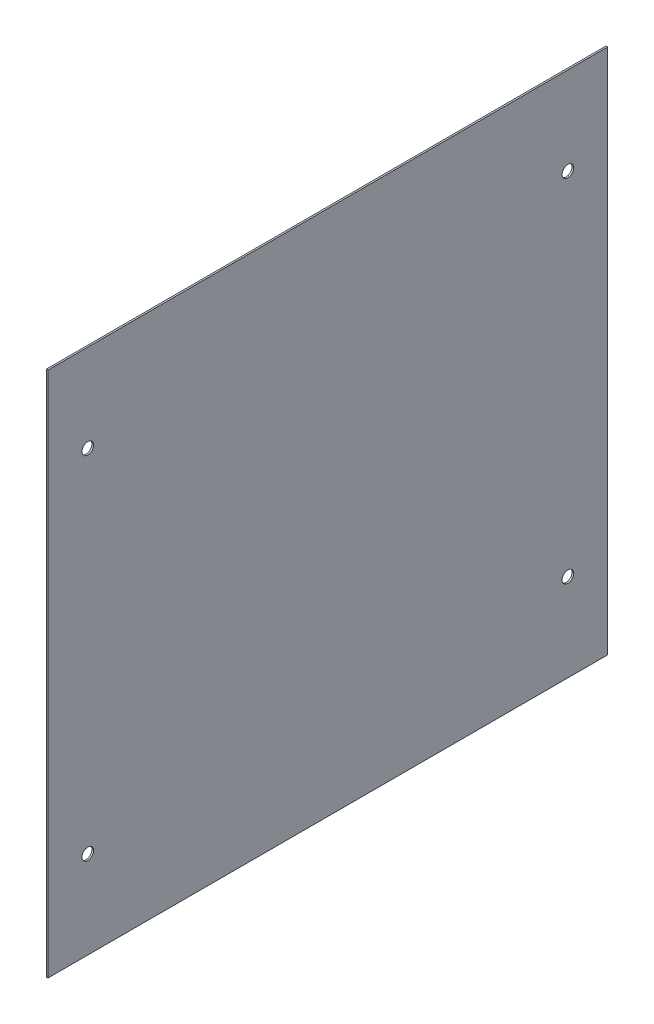
ISO-10303-21;
HEADER;
FILE_DESCRIPTION(('STEP AP214'),'2;1');
FILE_NAME('part.step','',(''),(''),'','','');
FILE_SCHEMA(('AUTOMOTIVE_DESIGN { 1 0 10303 214 1 1 1 1 }'));
ENDSEC;
DATA;
#1=APPLICATION_CONTEXT('core data for automotive mechanical design processes');
#2=APPLICATION_PROTOCOL_DEFINITION('international standard','automotive_design',2000,#1);
#3=PRODUCT_CONTEXT('',#1,'mechanical');
#4=PRODUCT('Part','Part','',(#3));
#5=PRODUCT_RELATED_PRODUCT_CATEGORY('part','',(#4));
#6=PRODUCT_DEFINITION_FORMATION('','',#4);
#7=PRODUCT_DEFINITION_CONTEXT('part definition',#1,'design');
#8=PRODUCT_DEFINITION('design','',#6,#7);
#9=PRODUCT_DEFINITION_SHAPE('','',#8);
#10=(LENGTH_UNIT() NAMED_UNIT(*) SI_UNIT(.MILLI.,.METRE.));
#11=(NAMED_UNIT(*) PLANE_ANGLE_UNIT() SI_UNIT($,.RADIAN.));
#12=(NAMED_UNIT(*) SI_UNIT($,.STERADIAN.) SOLID_ANGLE_UNIT());
#13=UNCERTAINTY_MEASURE_WITH_UNIT(LENGTH_MEASURE(1.E-05),#10,'distance_accuracy_value','');
#14=(GEOMETRIC_REPRESENTATION_CONTEXT(3) GLOBAL_UNCERTAINTY_ASSIGNED_CONTEXT((#13)) GLOBAL_UNIT_ASSIGNED_CONTEXT((#10,
#11,#12)) REPRESENTATION_CONTEXT('',''));
#15=CARTESIAN_POINT('',(0.,0.,0.));
#16=DIRECTION('',(0.,0.,1.));
#17=DIRECTION('',(1.,0.,0.));
#18=AXIS2_PLACEMENT_3D('',#15,#16,#17);
#19=CARTESIAN_POINT('',(1.,0.,0.));
#20=DIRECTION('',(-1.,0.,0.));
#21=DIRECTION('',(0.,0.,1.));
#22=AXIS2_PLACEMENT_3D('',#19,#20,#21);
#23=PLANE('',#22);
#24=DIRECTION('',(0.,-1.,0.));
#25=VECTOR('',#24,1.);
#26=CARTESIAN_POINT('',(1.,0.,0.));
#27=LINE('',#26,#25);
#28=CARTESIAN_POINT('',(1.,318.,0.));
#29=VERTEX_POINT('',#28);
#30=CARTESIAN_POINT('',(1.,0.,0.));
#31=VERTEX_POINT('',#30);
#32=EDGE_CURVE('E98',#29,#31,#27,.T.);
#33=ORIENTED_EDGE('',*,*,#32,.T.);
#34=DIRECTION('',(0.,0.,-1.));
#35=VECTOR('',#34,1.);
#36=CARTESIAN_POINT('',(1.,0.,0.));
#37=LINE('',#36,#35);
#38=CARTESIAN_POINT('',(1.,0.,-338.));
#39=VERTEX_POINT('',#38);
#40=EDGE_CURVE('E93',#31,#39,#37,.T.);
#41=ORIENTED_EDGE('',*,*,#40,.T.);
#42=DIRECTION('',(0.,1.,0.));
#43=VECTOR('',#42,1.);
#44=CARTESIAN_POINT('',(1.,0.,-338.));
#45=LINE('',#44,#43);
#46=CARTESIAN_POINT('',(1.,318.,-338.));
#47=VERTEX_POINT('',#46);
#48=EDGE_CURVE('E96',#39,#47,#45,.T.);
#49=ORIENTED_EDGE('',*,*,#48,.T.);
#50=DIRECTION('',(0.,0.,1.));
#51=VECTOR('',#50,1.);
#52=CARTESIAN_POINT('',(1.,318.,0.));
#53=LINE('',#52,#51);
#54=EDGE_CURVE('E63',#47,#29,#53,.T.);
#55=ORIENTED_EDGE('',*,*,#54,.T.);
#56=EDGE_LOOP('',(#33,#41,#49,#55));
#57=FACE_BOUND('',#56,.T.);
#58=CARTESIAN_POINT('',(1.,265.06,-24.));
#59=DIRECTION('',(1.,0.,0.));
#60=DIRECTION('',(0.,0.,-1.));
#61=AXIS2_PLACEMENT_3D('',#58,#59,#60);
#62=CIRCLE('',#61,3.5);
#63=CARTESIAN_POINT('',(1.,265.06,-27.5));
#64=VERTEX_POINT('',#63);
#65=EDGE_CURVE('E118',#64,#64,#62,.T.);
#66=ORIENTED_EDGE('',*,*,#65,.F.);
#67=EDGE_LOOP('',(#66));
#68=FACE_BOUND('',#67,.T.);
#69=CARTESIAN_POINT('',(1.,265.06,-314.));
#70=DIRECTION('',(1.,0.,0.));
#71=DIRECTION('',(0.,0.,-1.));
#72=AXIS2_PLACEMENT_3D('',#69,#70,#71);
#73=CIRCLE('',#72,3.50000000000002);
#74=CARTESIAN_POINT('',(1.,265.06,-317.5));
#75=VERTEX_POINT('',#74);
#76=EDGE_CURVE('E140',#75,#75,#73,.T.);
#77=ORIENTED_EDGE('',*,*,#76,.F.);
#78=EDGE_LOOP('',(#77));
#79=FACE_BOUND('',#78,.T.);
#80=CARTESIAN_POINT('',(1.,52.94,-314.));
#81=DIRECTION('',(1.,0.,0.));
#82=DIRECTION('',(0.,0.,-1.));
#83=AXIS2_PLACEMENT_3D('',#80,#81,#82);
#84=CIRCLE('',#83,3.50000000000002);
#85=CARTESIAN_POINT('',(1.,52.94,-317.5));
#86=VERTEX_POINT('',#85);
#87=EDGE_CURVE('E148',#86,#86,#84,.T.);
#88=ORIENTED_EDGE('',*,*,#87,.F.);
#89=EDGE_LOOP('',(#88));
#90=FACE_BOUND('',#89,.T.);
#91=CARTESIAN_POINT('',(1.,52.94,-24.));
#92=DIRECTION('',(1.,0.,0.));
#93=DIRECTION('',(0.,0.,-1.));
#94=AXIS2_PLACEMENT_3D('',#91,#92,#93);
#95=CIRCLE('',#94,3.5);
#96=CARTESIAN_POINT('',(1.,52.94,-27.5));
#97=VERTEX_POINT('',#96);
#98=EDGE_CURVE('E156',#97,#97,#95,.T.);
#99=ORIENTED_EDGE('',*,*,#98,.F.);
#100=EDGE_LOOP('',(#99));
#101=FACE_BOUND('',#100,.T.);
#102=ADVANCED_FACE('F45',(#57,#68,#79,#90,#101),#23,.F.);
#103=CARTESIAN_POINT('',(0.,0.,0.));
#104=DIRECTION('',(-1.,0.,0.));
#105=DIRECTION('',(0.,0.,1.));
#106=AXIS2_PLACEMENT_3D('',#103,#104,#105);
#107=PLANE('',#106);
#108=CARTESIAN_POINT('',(0.,52.94,-314.));
#109=DIRECTION('',(1.,0.,0.));
#110=DIRECTION('',(0.,0.,-1.));
#111=AXIS2_PLACEMENT_3D('',#108,#109,#110);
#112=CIRCLE('',#111,3.50000000000002);
#113=CARTESIAN_POINT('',(0.,52.94,-317.5));
#114=VERTEX_POINT('',#113);
#115=EDGE_CURVE('E152',#114,#114,#112,.T.);
#116=ORIENTED_EDGE('',*,*,#115,.T.);
#117=EDGE_LOOP('',(#116));
#118=FACE_BOUND('',#117,.T.);
#119=CARTESIAN_POINT('',(0.,265.06,-24.));
#120=DIRECTION('',(1.,0.,0.));
#121=DIRECTION('',(0.,0.,-1.));
#122=AXIS2_PLACEMENT_3D('',#119,#120,#121);
#123=CIRCLE('',#122,3.5);
#124=CARTESIAN_POINT('',(0.,265.06,-27.5));
#125=VERTEX_POINT('',#124);
#126=EDGE_CURVE('E136',#125,#125,#123,.T.);
#127=ORIENTED_EDGE('',*,*,#126,.T.);
#128=EDGE_LOOP('',(#127));
#129=FACE_BOUND('',#128,.T.);
#130=DIRECTION('',(0.,-1.,0.));
#131=VECTOR('',#130,1.);
#132=CARTESIAN_POINT('',(0.,0.,0.));
#133=LINE('',#132,#131);
#134=CARTESIAN_POINT('',(0.,318.,0.));
#135=VERTEX_POINT('',#134);
#136=CARTESIAN_POINT('',(0.,0.,0.));
#137=VERTEX_POINT('',#136);
#138=EDGE_CURVE('E114',#135,#137,#133,.T.);
#139=ORIENTED_EDGE('',*,*,#138,.F.);
#140=DIRECTION('',(0.,0.,1.));
#141=VECTOR('',#140,1.);
#142=CARTESIAN_POINT('',(0.,318.,0.));
#143=LINE('',#142,#141);
#144=CARTESIAN_POINT('',(0.,318.,-338.));
#145=VERTEX_POINT('',#144);
#146=EDGE_CURVE('E86',#145,#135,#143,.T.);
#147=ORIENTED_EDGE('',*,*,#146,.F.);
#148=DIRECTION('',(0.,1.,0.));
#149=VECTOR('',#148,1.);
#150=CARTESIAN_POINT('',(0.,0.,-338.));
#151=LINE('',#150,#149);
#152=CARTESIAN_POINT('',(0.,0.,-338.));
#153=VERTEX_POINT('',#152);
#154=EDGE_CURVE('E80',#153,#145,#151,.T.);
#155=ORIENTED_EDGE('',*,*,#154,.F.);
#156=DIRECTION('',(0.,0.,-1.));
#157=VECTOR('',#156,1.);
#158=CARTESIAN_POINT('',(0.,0.,0.));
#159=LINE('',#158,#157);
#160=EDGE_CURVE('E103',#137,#153,#159,.T.);
#161=ORIENTED_EDGE('',*,*,#160,.F.);
#162=EDGE_LOOP('',(#139,#147,#155,#161));
#163=FACE_BOUND('',#162,.T.);
#164=CARTESIAN_POINT('',(0.,265.06,-314.));
#165=DIRECTION('',(1.,0.,0.));
#166=DIRECTION('',(0.,0.,-1.));
#167=AXIS2_PLACEMENT_3D('',#164,#165,#166);
#168=CIRCLE('',#167,3.50000000000002);
#169=CARTESIAN_POINT('',(0.,265.06,-317.5));
#170=VERTEX_POINT('',#169);
#171=EDGE_CURVE('E144',#170,#170,#168,.T.);
#172=ORIENTED_EDGE('',*,*,#171,.T.);
#173=EDGE_LOOP('',(#172));
#174=FACE_BOUND('',#173,.T.);
#175=CARTESIAN_POINT('',(0.,52.94,-24.));
#176=DIRECTION('',(1.,0.,0.));
#177=DIRECTION('',(0.,0.,-1.));
#178=AXIS2_PLACEMENT_3D('',#175,#176,#177);
#179=CIRCLE('',#178,3.5);
#180=CARTESIAN_POINT('',(0.,52.94,-27.5));
#181=VERTEX_POINT('',#180);
#182=EDGE_CURVE('E160',#181,#181,#179,.T.);
#183=ORIENTED_EDGE('',*,*,#182,.T.);
#184=EDGE_LOOP('',(#183));
#185=FACE_BOUND('',#184,.T.);
#186=ADVANCED_FACE('F131',(#118,#129,#163,#174,#185),#107,.T.);
#187=CARTESIAN_POINT('',(1.,0.,0.));
#188=DIRECTION('',(0.,0.,-1.));
#189=DIRECTION('',(-1.,0.,0.));
#190=AXIS2_PLACEMENT_3D('',#187,#188,#189);
#191=PLANE('',#190);
#192=ORIENTED_EDGE('',*,*,#138,.T.);
#193=DIRECTION('',(-1.,0.,0.));
#194=VECTOR('',#193,1.);
#195=CARTESIAN_POINT('',(1.,0.,0.));
#196=LINE('',#195,#194);
#197=EDGE_CURVE('E11',#31,#137,#196,.T.);
#198=ORIENTED_EDGE('',*,*,#197,.F.);
#199=ORIENTED_EDGE('',*,*,#32,.F.);
#200=DIRECTION('',(-1.,0.,0.));
#201=VECTOR('',#200,1.);
#202=CARTESIAN_POINT('',(1.,318.,0.));
#203=LINE('',#202,#201);
#204=EDGE_CURVE('E110',#29,#135,#203,.T.);
#205=ORIENTED_EDGE('',*,*,#204,.T.);
#206=EDGE_LOOP('',(#192,#198,#199,#205));
#207=FACE_BOUND('',#206,.T.);
#208=ADVANCED_FACE('F47',(#207),#191,.F.);
#209=CARTESIAN_POINT('',(1.,0.,0.));
#210=DIRECTION('',(0.,1.,0.));
#211=DIRECTION('',(0.,0.,1.));
#212=AXIS2_PLACEMENT_3D('',#209,#210,#211);
#213=PLANE('',#212);
#214=ORIENTED_EDGE('',*,*,#160,.T.);
#215=DIRECTION('',(-1.,0.,0.));
#216=VECTOR('',#215,1.);
#217=CARTESIAN_POINT('',(1.,0.,-338.));
#218=LINE('',#217,#216);
#219=EDGE_CURVE('E55',#39,#153,#218,.T.);
#220=ORIENTED_EDGE('',*,*,#219,.F.);
#221=ORIENTED_EDGE('',*,*,#40,.F.);
#222=ORIENTED_EDGE('',*,*,#197,.T.);
#223=EDGE_LOOP('',(#214,#220,#221,#222));
#224=FACE_BOUND('',#223,.T.);
#225=ADVANCED_FACE('F102',(#224),#213,.F.);
#226=CARTESIAN_POINT('',(1.,0.,-338.));
#227=DIRECTION('',(0.,0.,1.));
#228=DIRECTION('',(1.,0.,0.));
#229=AXIS2_PLACEMENT_3D('',#226,#227,#228);
#230=PLANE('',#229);
#231=ORIENTED_EDGE('',*,*,#154,.T.);
#232=DIRECTION('',(-1.,0.,0.));
#233=VECTOR('',#232,1.);
#234=CARTESIAN_POINT('',(1.,318.,-338.));
#235=LINE('',#234,#233);
#236=EDGE_CURVE('E105',#47,#145,#235,.T.);
#237=ORIENTED_EDGE('',*,*,#236,.F.);
#238=ORIENTED_EDGE('',*,*,#48,.F.);
#239=ORIENTED_EDGE('',*,*,#219,.T.);
#240=EDGE_LOOP('',(#231,#237,#238,#239));
#241=FACE_BOUND('',#240,.T.);
#242=ADVANCED_FACE('F106',(#241),#230,.F.);
#243=CARTESIAN_POINT('',(1.,318.,0.));
#244=DIRECTION('',(0.,-1.,0.));
#245=DIRECTION('',(0.,0.,-1.));
#246=AXIS2_PLACEMENT_3D('',#243,#244,#245);
#247=PLANE('',#246);
#248=ORIENTED_EDGE('',*,*,#146,.T.);
#249=ORIENTED_EDGE('',*,*,#204,.F.);
#250=ORIENTED_EDGE('',*,*,#54,.F.);
#251=ORIENTED_EDGE('',*,*,#236,.T.);
#252=EDGE_LOOP('',(#248,#249,#250,#251));
#253=FACE_BOUND('',#252,.T.);
#254=ADVANCED_FACE('F128',(#253),#247,.F.);
#255=CARTESIAN_POINT('',(1.,265.06,-24.));
#256=DIRECTION('',(-1.,0.,0.));
#257=DIRECTION('',(0.,0.,1.));
#258=AXIS2_PLACEMENT_3D('',#255,#256,#257);
#259=CYLINDRICAL_SURFACE('',#258,3.5);
#260=ORIENTED_EDGE('',*,*,#65,.T.);
#261=EDGE_LOOP('',(#260));
#262=FACE_BOUND('',#261,.T.);
#263=ORIENTED_EDGE('',*,*,#126,.F.);
#264=EDGE_LOOP('',(#263));
#265=FACE_BOUND('',#264,.T.);
#266=ADVANCED_FACE('F179',(#262,#265),#259,.F.);
#267=CARTESIAN_POINT('',(1.,265.06,-314.));
#268=DIRECTION('',(-1.,0.,0.));
#269=DIRECTION('',(0.,0.,1.));
#270=AXIS2_PLACEMENT_3D('',#267,#268,#269);
#271=CYLINDRICAL_SURFACE('',#270,3.50000000000002);
#272=ORIENTED_EDGE('',*,*,#76,.T.);
#273=EDGE_LOOP('',(#272));
#274=FACE_BOUND('',#273,.T.);
#275=ORIENTED_EDGE('',*,*,#171,.F.);
#276=EDGE_LOOP('',(#275));
#277=FACE_BOUND('',#276,.T.);
#278=ADVANCED_FACE('F224',(#274,#277),#271,.F.);
#279=CARTESIAN_POINT('',(1.,52.94,-314.));
#280=DIRECTION('',(-1.,0.,0.));
#281=DIRECTION('',(0.,0.,1.));
#282=AXIS2_PLACEMENT_3D('',#279,#280,#281);
#283=CYLINDRICAL_SURFACE('',#282,3.50000000000002);
#284=ORIENTED_EDGE('',*,*,#87,.T.);
#285=EDGE_LOOP('',(#284));
#286=FACE_BOUND('',#285,.T.);
#287=ORIENTED_EDGE('',*,*,#115,.F.);
#288=EDGE_LOOP('',(#287));
#289=FACE_BOUND('',#288,.T.);
#290=ADVANCED_FACE('F232',(#286,#289),#283,.F.);
#291=CARTESIAN_POINT('',(1.,52.94,-24.));
#292=DIRECTION('',(-1.,0.,0.));
#293=DIRECTION('',(0.,0.,1.));
#294=AXIS2_PLACEMENT_3D('',#291,#292,#293);
#295=CYLINDRICAL_SURFACE('',#294,3.5);
#296=ORIENTED_EDGE('',*,*,#98,.T.);
#297=EDGE_LOOP('',(#296));
#298=FACE_BOUND('',#297,.T.);
#299=ORIENTED_EDGE('',*,*,#182,.F.);
#300=EDGE_LOOP('',(#299));
#301=FACE_BOUND('',#300,.T.);
#302=ADVANCED_FACE('F168',(#298,#301),#295,.F.);
#303=CLOSED_SHELL('',(#102,#186,#208,#225,#242,#254,#266,#278,#290,#302));
#304=MANIFOLD_SOLID_BREP('B2',#303);
#305=ADVANCED_BREP_SHAPE_REPRESENTATION('',(#18,#304),#14);
#306=SHAPE_DEFINITION_REPRESENTATION(#9,#305);
ENDSEC;
END-ISO-10303-21;
